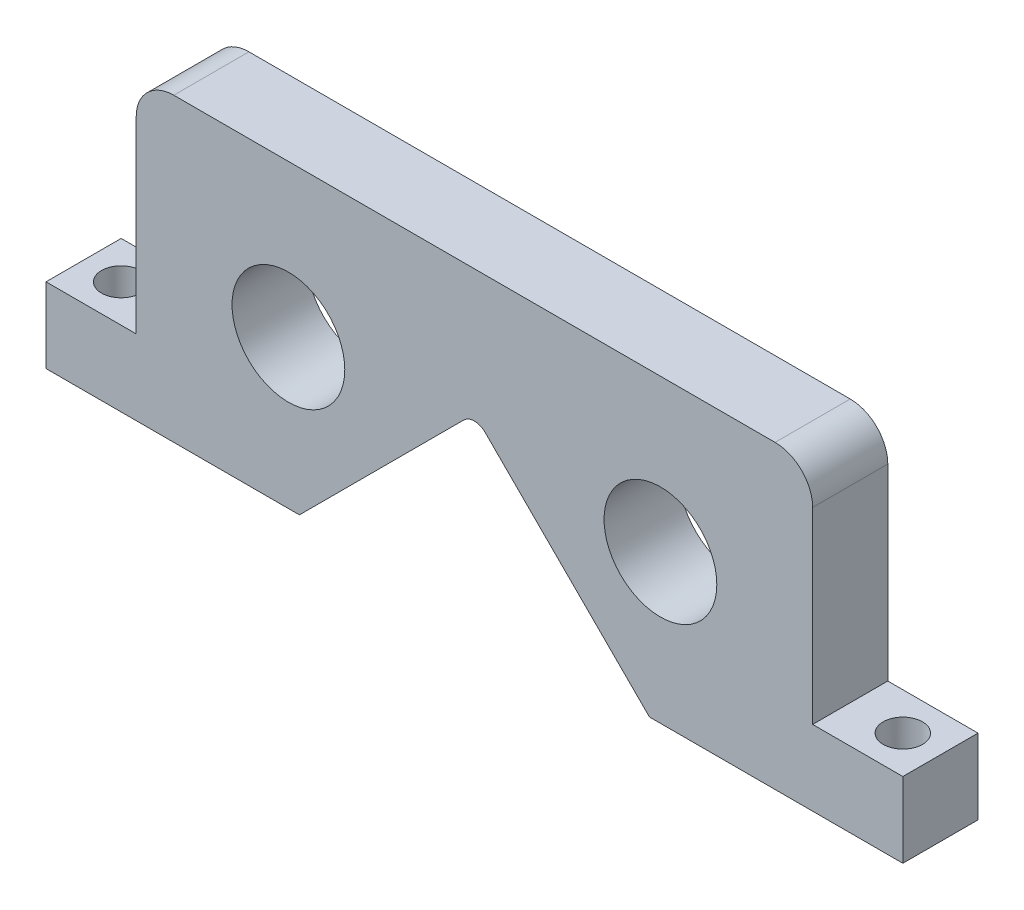
ISO-10303-21;
HEADER;
FILE_DESCRIPTION(('STEP AP214'),'2;1');
FILE_NAME('part.step','',(''),(''),'','','');
FILE_SCHEMA(('AUTOMOTIVE_DESIGN { 1 0 10303 214 1 1 1 1 }'));
ENDSEC;
DATA;
#1=APPLICATION_CONTEXT('core data for automotive mechanical design processes');
#2=APPLICATION_PROTOCOL_DEFINITION('international standard','automotive_design',2000,#1);
#3=PRODUCT_CONTEXT('',#1,'mechanical');
#4=PRODUCT('Part','Part','',(#3));
#5=PRODUCT_RELATED_PRODUCT_CATEGORY('part','',(#4));
#6=PRODUCT_DEFINITION_FORMATION('','',#4);
#7=PRODUCT_DEFINITION_CONTEXT('part definition',#1,'design');
#8=PRODUCT_DEFINITION('design','',#6,#7);
#9=PRODUCT_DEFINITION_SHAPE('','',#8);
#10=(LENGTH_UNIT() NAMED_UNIT(*) SI_UNIT(.MILLI.,.METRE.));
#11=(NAMED_UNIT(*) PLANE_ANGLE_UNIT() SI_UNIT($,.RADIAN.));
#12=(NAMED_UNIT(*) SI_UNIT($,.STERADIAN.) SOLID_ANGLE_UNIT());
#13=UNCERTAINTY_MEASURE_WITH_UNIT(LENGTH_MEASURE(1.E-05),#10,'distance_accuracy_value','');
#14=(GEOMETRIC_REPRESENTATION_CONTEXT(3) GLOBAL_UNCERTAINTY_ASSIGNED_CONTEXT((#13)) GLOBAL_UNIT_ASSIGNED_CONTEXT((#10,
#11,#12)) REPRESENTATION_CONTEXT('',''));
#15=CARTESIAN_POINT('',(0.,0.,0.));
#16=DIRECTION('',(0.,0.,1.));
#17=DIRECTION('',(1.,0.,0.));
#18=AXIS2_PLACEMENT_3D('',#15,#16,#17);
#19=CARTESIAN_POINT('',(0.,25.4558441227157,5.));
#20=DIRECTION('',(0.,0.,-1.));
#21=DIRECTION('',(-1.,0.,0.));
#22=AXIS2_PLACEMENT_3D('',#19,#20,#21);
#23=CYLINDRICAL_SURFACE('',#22,2.);
#24=CARTESIAN_POINT('',(0.,25.4558441227157,-5.));
#25=DIRECTION('',(0.,0.,1.));
#26=DIRECTION('',(1.,0.,0.));
#27=AXIS2_PLACEMENT_3D('',#24,#25,#26);
#28=CIRCLE('',#27,2.);
#29=CARTESIAN_POINT('',(1.41421356237311,26.8700576850888,-5.));
#30=VERTEX_POINT('',#29);
#31=CARTESIAN_POINT('',(-1.4142135623731,26.8700576850888,-5.));
#32=VERTEX_POINT('',#31);
#33=EDGE_CURVE('E184',#30,#32,#28,.T.);
#34=ORIENTED_EDGE('',*,*,#33,.F.);
#35=DIRECTION('',(0.,0.,-1.));
#36=VECTOR('',#35,1.);
#37=CARTESIAN_POINT('',(1.41421356237311,26.8700576850888,5.));
#38=LINE('',#37,#36);
#39=CARTESIAN_POINT('',(1.41421356237311,26.8700576850888,5.));
#40=VERTEX_POINT('',#39);
#41=EDGE_CURVE('E11',#40,#30,#38,.T.);
#42=ORIENTED_EDGE('',*,*,#41,.F.);
#43=CARTESIAN_POINT('',(0.,25.4558441227157,5.));
#44=DIRECTION('',(0.,0.,1.));
#45=DIRECTION('',(1.,0.,0.));
#46=AXIS2_PLACEMENT_3D('',#43,#44,#45);
#47=CIRCLE('',#46,2.);
#48=CARTESIAN_POINT('',(-1.4142135623731,26.8700576850888,5.));
#49=VERTEX_POINT('',#48);
#50=EDGE_CURVE('E176',#40,#49,#47,.T.);
#51=ORIENTED_EDGE('',*,*,#50,.T.);
#52=DIRECTION('',(0.,0.,-1.));
#53=VECTOR('',#52,1.);
#54=CARTESIAN_POINT('',(-1.4142135623731,26.8700576850888,5.));
#55=LINE('',#54,#53);
#56=EDGE_CURVE('E105',#49,#32,#55,.T.);
#57=ORIENTED_EDGE('',*,*,#56,.T.);
#58=EDGE_LOOP('',(#34,#42,#51,#57));
#59=FACE_BOUND('',#58,.T.);
#60=ADVANCED_FACE('F35',(#59),#23,.F.);
#61=CARTESIAN_POINT('',(14.142135623731,14.1421356237309,5.));
#62=DIRECTION('',(-0.707106781186548,-0.707106781186547,0.));
#63=DIRECTION('',(0.707106781186547,-0.707106781186548,0.));
#64=AXIS2_PLACEMENT_3D('',#61,#62,#63);
#65=PLANE('',#64);
#66=DIRECTION('',(-0.707106781186547,0.707106781186548,0.));
#67=VECTOR('',#66,1.);
#68=CARTESIAN_POINT('',(14.142135623731,14.1421356237309,-5.));
#69=LINE('',#68,#67);
#70=CARTESIAN_POINT('',(23.2842712474619,5.00000000000001,-5.));
#71=VERTEX_POINT('',#70);
#72=EDGE_CURVE('E218',#71,#30,#69,.T.);
#73=ORIENTED_EDGE('',*,*,#72,.F.);
#74=DIRECTION('',(0.,0.,-1.));
#75=VECTOR('',#74,1.);
#76=CARTESIAN_POINT('',(23.2842712474619,5.00000000000001,5.));
#77=LINE('',#76,#75);
#78=CARTESIAN_POINT('',(23.2842712474619,5.00000000000001,5.));
#79=VERTEX_POINT('',#78);
#80=EDGE_CURVE('E44',#79,#71,#77,.T.);
#81=ORIENTED_EDGE('',*,*,#80,.F.);
#82=DIRECTION('',(-0.707106781186547,0.707106781186548,0.));
#83=VECTOR('',#82,1.);
#84=CARTESIAN_POINT('',(14.142135623731,14.1421356237309,5.));
#85=LINE('',#84,#83);
#86=EDGE_CURVE('E168',#79,#40,#85,.T.);
#87=ORIENTED_EDGE('',*,*,#86,.T.);
#88=ORIENTED_EDGE('',*,*,#41,.T.);
#89=EDGE_LOOP('',(#73,#81,#87,#88));
#90=FACE_BOUND('',#89,.T.);
#91=ADVANCED_FACE('F209',(#90),#65,.T.);
#92=CARTESIAN_POINT('',(0.,5.00000000000001,5.));
#93=DIRECTION('',(0.,1.,0.));
#94=DIRECTION('',(0.,0.,1.));
#95=AXIS2_PLACEMENT_3D('',#92,#93,#94);
#96=PLANE('',#95);
#97=CARTESIAN_POINT('',(52.,5.00000000000001,0.));
#98=DIRECTION('',(0.,-1.,0.));
#99=DIRECTION('',(0.,0.,1.));
#100=AXIS2_PLACEMENT_3D('',#97,#98,#99);
#101=CIRCLE('',#100,2.61209519362042);
#102=CARTESIAN_POINT('',(52.,5.00000000000001,2.61209519362042));
#103=VERTEX_POINT('',#102);
#104=EDGE_CURVE('E188',#103,#103,#101,.T.);
#105=ORIENTED_EDGE('',*,*,#104,.F.);
#106=EDGE_LOOP('',(#105));
#107=FACE_BOUND('',#106,.T.);
#108=DIRECTION('',(1.,0.,0.));
#109=VECTOR('',#108,1.);
#110=CARTESIAN_POINT('',(0.,5.00000000000001,-5.));
#111=LINE('',#110,#109);
#112=CARTESIAN_POINT('',(57.,5.00000000000001,-5.));
#113=VERTEX_POINT('',#112);
#114=EDGE_CURVE('E225',#71,#113,#111,.T.);
#115=ORIENTED_EDGE('',*,*,#114,.T.);
#116=DIRECTION('',(0.,0.,-1.));
#117=VECTOR('',#116,1.);
#118=CARTESIAN_POINT('',(57.,5.00000000000001,5.));
#119=LINE('',#118,#117);
#120=CARTESIAN_POINT('',(57.,5.00000000000001,5.));
#121=VERTEX_POINT('',#120);
#122=EDGE_CURVE('E278',#121,#113,#119,.T.);
#123=ORIENTED_EDGE('',*,*,#122,.F.);
#124=DIRECTION('',(1.,0.,0.));
#125=VECTOR('',#124,1.);
#126=CARTESIAN_POINT('',(0.,5.00000000000001,5.));
#127=LINE('',#126,#125);
#128=EDGE_CURVE('E162',#79,#121,#127,.T.);
#129=ORIENTED_EDGE('',*,*,#128,.F.);
#130=ORIENTED_EDGE('',*,*,#80,.T.);
#131=EDGE_LOOP('',(#115,#123,#129,#130));
#132=FACE_BOUND('',#131,.T.);
#133=ADVANCED_FACE('F213',(#107,#132),#96,.F.);
#134=CARTESIAN_POINT('',(57.,0.,5.));
#135=DIRECTION('',(1.,0.,0.));
#136=DIRECTION('',(0.,0.,-1.));
#137=AXIS2_PLACEMENT_3D('',#134,#135,#136);
#138=PLANE('',#137);
#139=DIRECTION('',(0.,-1.,0.));
#140=VECTOR('',#139,1.);
#141=CARTESIAN_POINT('',(57.,0.,-5.));
#142=LINE('',#141,#140);
#143=CARTESIAN_POINT('',(57.,15.,-5.));
#144=VERTEX_POINT('',#143);
#145=EDGE_CURVE('E227',#144,#113,#142,.T.);
#146=ORIENTED_EDGE('',*,*,#145,.F.);
#147=DIRECTION('',(0.,0.,-1.));
#148=VECTOR('',#147,1.);
#149=CARTESIAN_POINT('',(57.,15.,5.));
#150=LINE('',#149,#148);
#151=CARTESIAN_POINT('',(57.,15.,5.));
#152=VERTEX_POINT('',#151);
#153=EDGE_CURVE('E276',#152,#144,#150,.T.);
#154=ORIENTED_EDGE('',*,*,#153,.F.);
#155=DIRECTION('',(0.,-1.,0.));
#156=VECTOR('',#155,1.);
#157=CARTESIAN_POINT('',(57.,0.,5.));
#158=LINE('',#157,#156);
#159=EDGE_CURVE('E167',#152,#121,#158,.T.);
#160=ORIENTED_EDGE('',*,*,#159,.T.);
#161=ORIENTED_EDGE('',*,*,#122,.T.);
#162=EDGE_LOOP('',(#146,#154,#160,#161));
#163=FACE_BOUND('',#162,.T.);
#164=ADVANCED_FACE('F283',(#163),#138,.T.);
#165=CARTESIAN_POINT('',(0.,15.,5.));
#166=DIRECTION('',(0.,-1.,0.));
#167=DIRECTION('',(1.,0.,0.));
#168=AXIS2_PLACEMENT_3D('',#165,#166,#167);
#169=PLANE('',#168);
#170=CARTESIAN_POINT('',(52.,15.,0.));
#171=DIRECTION('',(0.,-1.,0.));
#172=DIRECTION('',(1.,0.,0.));
#173=AXIS2_PLACEMENT_3D('',#170,#171,#172);
#174=CIRCLE('',#173,2.61209519362042);
#175=CARTESIAN_POINT('',(54.6120951936205,15.,0.));
#176=VERTEX_POINT('',#175);
#177=EDGE_CURVE('E38',#176,#176,#174,.T.);
#178=ORIENTED_EDGE('',*,*,#177,.T.);
#179=EDGE_LOOP('',(#178));
#180=FACE_BOUND('',#179,.T.);
#181=DIRECTION('',(-1.,0.,0.));
#182=VECTOR('',#181,1.);
#183=CARTESIAN_POINT('',(0.,15.,-5.));
#184=LINE('',#183,#182);
#185=CARTESIAN_POINT('',(45.,15.,-5.));
#186=VERTEX_POINT('',#185);
#187=EDGE_CURVE('E232',#144,#186,#184,.T.);
#188=ORIENTED_EDGE('',*,*,#187,.T.);
#189=DIRECTION('',(0.,0.,-1.));
#190=VECTOR('',#189,1.);
#191=CARTESIAN_POINT('',(45.,15.,5.));
#192=LINE('',#191,#190);
#193=CARTESIAN_POINT('',(45.,15.,5.));
#194=VERTEX_POINT('',#193);
#195=EDGE_CURVE('E273',#194,#186,#192,.T.);
#196=ORIENTED_EDGE('',*,*,#195,.F.);
#197=DIRECTION('',(-1.,0.,0.));
#198=VECTOR('',#197,1.);
#199=CARTESIAN_POINT('',(0.,15.,5.));
#200=LINE('',#199,#198);
#201=EDGE_CURVE('E174',#152,#194,#200,.T.);
#202=ORIENTED_EDGE('',*,*,#201,.F.);
#203=ORIENTED_EDGE('',*,*,#153,.T.);
#204=EDGE_LOOP('',(#188,#196,#202,#203));
#205=FACE_BOUND('',#204,.T.);
#206=ADVANCED_FACE('F195',(#180,#205),#169,.F.);
#207=CARTESIAN_POINT('',(45.,0.,5.));
#208=DIRECTION('',(-1.,0.,0.));
#209=DIRECTION('',(0.,-1.,0.));
#210=AXIS2_PLACEMENT_3D('',#207,#208,#209);
#211=PLANE('',#210);
#212=DIRECTION('',(0.,1.,0.));
#213=VECTOR('',#212,1.);
#214=CARTESIAN_POINT('',(45.,0.,-5.));
#215=LINE('',#214,#213);
#216=CARTESIAN_POINT('',(45.,40.,-5.));
#217=VERTEX_POINT('',#216);
#218=EDGE_CURVE('E234',#186,#217,#215,.T.);
#219=ORIENTED_EDGE('',*,*,#218,.T.);
#220=DIRECTION('',(0.,0.,-1.));
#221=VECTOR('',#220,1.);
#222=CARTESIAN_POINT('',(45.,40.,5.));
#223=LINE('',#222,#221);
#224=CARTESIAN_POINT('',(45.,40.,5.));
#225=VERTEX_POINT('',#224);
#226=EDGE_CURVE('E270',#225,#217,#223,.T.);
#227=ORIENTED_EDGE('',*,*,#226,.F.);
#228=DIRECTION('',(0.,1.,0.));
#229=VECTOR('',#228,1.);
#230=CARTESIAN_POINT('',(45.,0.,5.));
#231=LINE('',#230,#229);
#232=EDGE_CURVE('E287',#194,#225,#231,.T.);
#233=ORIENTED_EDGE('',*,*,#232,.F.);
#234=ORIENTED_EDGE('',*,*,#195,.T.);
#235=EDGE_LOOP('',(#219,#227,#233,#234));
#236=FACE_BOUND('',#235,.T.);
#237=ADVANCED_FACE('F293',(#236),#211,.F.);
#238=CARTESIAN_POINT('',(40.,40.,5.));
#239=DIRECTION('',(0.,0.,-1.));
#240=DIRECTION('',(-1.,0.,0.));
#241=AXIS2_PLACEMENT_3D('',#238,#239,#240);
#242=CYLINDRICAL_SURFACE('',#241,4.99999999999999);
#243=CARTESIAN_POINT('',(40.,40.,-5.));
#244=DIRECTION('',(0.,0.,1.));
#245=DIRECTION('',(1.,0.,0.));
#246=AXIS2_PLACEMENT_3D('',#243,#244,#245);
#247=CIRCLE('',#246,4.99999999999999);
#248=CARTESIAN_POINT('',(40.,45.,-5.));
#249=VERTEX_POINT('',#248);
#250=EDGE_CURVE('E236',#217,#249,#247,.T.);
#251=ORIENTED_EDGE('',*,*,#250,.T.);
#252=DIRECTION('',(0.,0.,-1.));
#253=VECTOR('',#252,1.);
#254=CARTESIAN_POINT('',(40.,45.,5.));
#255=LINE('',#254,#253);
#256=CARTESIAN_POINT('',(40.,45.,5.));
#257=VERTEX_POINT('',#256);
#258=EDGE_CURVE('E267',#257,#249,#255,.T.);
#259=ORIENTED_EDGE('',*,*,#258,.F.);
#260=CARTESIAN_POINT('',(40.,40.,5.));
#261=DIRECTION('',(0.,0.,1.));
#262=DIRECTION('',(1.,0.,0.));
#263=AXIS2_PLACEMENT_3D('',#260,#261,#262);
#264=CIRCLE('',#263,4.99999999999999);
#265=EDGE_CURVE('E295',#225,#257,#264,.T.);
#266=ORIENTED_EDGE('',*,*,#265,.F.);
#267=ORIENTED_EDGE('',*,*,#226,.T.);
#268=EDGE_LOOP('',(#251,#259,#266,#267));
#269=FACE_BOUND('',#268,.T.);
#270=ADVANCED_FACE('F352',(#269),#242,.T.);
#271=CARTESIAN_POINT('',(0.,45.,5.));
#272=DIRECTION('',(0.,-1.,0.));
#273=DIRECTION('',(0.,0.,-1.));
#274=AXIS2_PLACEMENT_3D('',#271,#272,#273);
#275=PLANE('',#274);
#276=DIRECTION('',(-1.,0.,0.));
#277=VECTOR('',#276,1.);
#278=CARTESIAN_POINT('',(0.,45.,-5.));
#279=LINE('',#278,#277);
#280=CARTESIAN_POINT('',(-40.,45.,-5.));
#281=VERTEX_POINT('',#280);
#282=EDGE_CURVE('E238',#249,#281,#279,.T.);
#283=ORIENTED_EDGE('',*,*,#282,.T.);
#284=DIRECTION('',(0.,0.,-1.));
#285=VECTOR('',#284,1.);
#286=CARTESIAN_POINT('',(-40.,45.,5.));
#287=LINE('',#286,#285);
#288=CARTESIAN_POINT('',(-40.,45.,5.));
#289=VERTEX_POINT('',#288);
#290=EDGE_CURVE('E264',#289,#281,#287,.T.);
#291=ORIENTED_EDGE('',*,*,#290,.F.);
#292=DIRECTION('',(-1.,0.,0.));
#293=VECTOR('',#292,1.);
#294=CARTESIAN_POINT('',(0.,45.,5.));
#295=LINE('',#294,#293);
#296=EDGE_CURVE('E297',#257,#289,#295,.T.);
#297=ORIENTED_EDGE('',*,*,#296,.F.);
#298=ORIENTED_EDGE('',*,*,#258,.T.);
#299=EDGE_LOOP('',(#283,#291,#297,#298));
#300=FACE_BOUND('',#299,.T.);
#301=ADVANCED_FACE('F348',(#300),#275,.F.);
#302=CARTESIAN_POINT('',(-40.,40.,5.));
#303=DIRECTION('',(0.,0.,-1.));
#304=DIRECTION('',(-1.,0.,0.));
#305=AXIS2_PLACEMENT_3D('',#302,#303,#304);
#306=CYLINDRICAL_SURFACE('',#305,4.99999999999999);
#307=CARTESIAN_POINT('',(-40.,40.,-5.));
#308=DIRECTION('',(0.,0.,1.));
#309=DIRECTION('',(1.,0.,0.));
#310=AXIS2_PLACEMENT_3D('',#307,#308,#309);
#311=CIRCLE('',#310,4.99999999999999);
#312=CARTESIAN_POINT('',(-45.,40.,-5.));
#313=VERTEX_POINT('',#312);
#314=EDGE_CURVE('E240',#281,#313,#311,.T.);
#315=ORIENTED_EDGE('',*,*,#314,.T.);
#316=DIRECTION('',(0.,0.,-1.));
#317=VECTOR('',#316,1.);
#318=CARTESIAN_POINT('',(-45.,40.,5.));
#319=LINE('',#318,#317);
#320=CARTESIAN_POINT('',(-45.,40.,5.));
#321=VERTEX_POINT('',#320);
#322=EDGE_CURVE('E261',#321,#313,#319,.T.);
#323=ORIENTED_EDGE('',*,*,#322,.F.);
#324=CARTESIAN_POINT('',(-40.,40.,5.));
#325=DIRECTION('',(0.,0.,1.));
#326=DIRECTION('',(1.,0.,0.));
#327=AXIS2_PLACEMENT_3D('',#324,#325,#326);
#328=CIRCLE('',#327,4.99999999999999);
#329=EDGE_CURVE('E301',#289,#321,#328,.T.);
#330=ORIENTED_EDGE('',*,*,#329,.F.);
#331=ORIENTED_EDGE('',*,*,#290,.T.);
#332=EDGE_LOOP('',(#315,#323,#330,#331));
#333=FACE_BOUND('',#332,.T.);
#334=ADVANCED_FACE('F344',(#333),#306,.T.);
#335=CARTESIAN_POINT('',(-45.,0.,5.));
#336=DIRECTION('',(1.,0.,0.));
#337=DIRECTION('',(0.,1.,0.));
#338=AXIS2_PLACEMENT_3D('',#335,#336,#337);
#339=PLANE('',#338);
#340=DIRECTION('',(0.,-1.,0.));
#341=VECTOR('',#340,1.);
#342=CARTESIAN_POINT('',(-45.,0.,-5.));
#343=LINE('',#342,#341);
#344=CARTESIAN_POINT('',(-45.,15.,-5.));
#345=VERTEX_POINT('',#344);
#346=EDGE_CURVE('E242',#313,#345,#343,.T.);
#347=ORIENTED_EDGE('',*,*,#346,.T.);
#348=DIRECTION('',(0.,0.,-1.));
#349=VECTOR('',#348,1.);
#350=CARTESIAN_POINT('',(-45.,15.,5.));
#351=LINE('',#350,#349);
#352=CARTESIAN_POINT('',(-45.,15.,5.));
#353=VERTEX_POINT('',#352);
#354=EDGE_CURVE('E258',#353,#345,#351,.T.);
#355=ORIENTED_EDGE('',*,*,#354,.F.);
#356=DIRECTION('',(0.,-1.,0.));
#357=VECTOR('',#356,1.);
#358=CARTESIAN_POINT('',(-45.,0.,5.));
#359=LINE('',#358,#357);
#360=EDGE_CURVE('E303',#321,#353,#359,.T.);
#361=ORIENTED_EDGE('',*,*,#360,.F.);
#362=ORIENTED_EDGE('',*,*,#322,.T.);
#363=EDGE_LOOP('',(#347,#355,#361,#362));
#364=FACE_BOUND('',#363,.T.);
#365=ADVANCED_FACE('F340',(#364),#339,.F.);
#366=CARTESIAN_POINT('',(0.,15.,5.));
#367=DIRECTION('',(0.,-1.,0.));
#368=DIRECTION('',(1.,0.,0.));
#369=AXIS2_PLACEMENT_3D('',#366,#367,#368);
#370=PLANE('',#369);
#371=CARTESIAN_POINT('',(-52.,15.,0.));
#372=DIRECTION('',(0.,-1.,0.));
#373=DIRECTION('',(1.,0.,0.));
#374=AXIS2_PLACEMENT_3D('',#371,#372,#373);
#375=CIRCLE('',#374,2.61209519362042);
#376=CARTESIAN_POINT('',(-49.3879048063796,15.,0.));
#377=VERTEX_POINT('',#376);
#378=EDGE_CURVE('E181',#377,#377,#375,.T.);
#379=ORIENTED_EDGE('',*,*,#378,.T.);
#380=EDGE_LOOP('',(#379));
#381=FACE_BOUND('',#380,.T.);
#382=DIRECTION('',(-1.,0.,0.));
#383=VECTOR('',#382,1.);
#384=CARTESIAN_POINT('',(0.,15.,-5.));
#385=LINE('',#384,#383);
#386=CARTESIAN_POINT('',(-57.,15.,-5.));
#387=VERTEX_POINT('',#386);
#388=EDGE_CURVE('E244',#345,#387,#385,.T.);
#389=ORIENTED_EDGE('',*,*,#388,.T.);
#390=DIRECTION('',(0.,0.,-1.));
#391=VECTOR('',#390,1.);
#392=CARTESIAN_POINT('',(-57.,15.,5.));
#393=LINE('',#392,#391);
#394=CARTESIAN_POINT('',(-57.,15.,5.));
#395=VERTEX_POINT('',#394);
#396=EDGE_CURVE('E157',#395,#387,#393,.T.);
#397=ORIENTED_EDGE('',*,*,#396,.F.);
#398=DIRECTION('',(-1.,0.,0.));
#399=VECTOR('',#398,1.);
#400=CARTESIAN_POINT('',(0.,15.,5.));
#401=LINE('',#400,#399);
#402=EDGE_CURVE('E148',#353,#395,#401,.T.);
#403=ORIENTED_EDGE('',*,*,#402,.F.);
#404=ORIENTED_EDGE('',*,*,#354,.T.);
#405=EDGE_LOOP('',(#389,#397,#403,#404));
#406=FACE_BOUND('',#405,.T.);
#407=ADVANCED_FACE('F337',(#381,#406),#370,.F.);
#408=CARTESIAN_POINT('',(-57.,0.,5.));
#409=DIRECTION('',(1.,0.,0.));
#410=DIRECTION('',(0.,0.,-1.));
#411=AXIS2_PLACEMENT_3D('',#408,#409,#410);
#412=PLANE('',#411);
#413=DIRECTION('',(0.,-1.,0.));
#414=VECTOR('',#413,1.);
#415=CARTESIAN_POINT('',(-57.,0.,-5.));
#416=LINE('',#415,#414);
#417=CARTESIAN_POINT('',(-57.,5.00000000000001,-5.));
#418=VERTEX_POINT('',#417);
#419=EDGE_CURVE('E156',#387,#418,#416,.T.);
#420=ORIENTED_EDGE('',*,*,#419,.T.);
#421=DIRECTION('',(0.,0.,-1.));
#422=VECTOR('',#421,1.);
#423=CARTESIAN_POINT('',(-57.,5.00000000000001,5.));
#424=LINE('',#423,#422);
#425=CARTESIAN_POINT('',(-57.,5.00000000000001,5.));
#426=VERTEX_POINT('',#425);
#427=EDGE_CURVE('E153',#426,#418,#424,.T.);
#428=ORIENTED_EDGE('',*,*,#427,.F.);
#429=DIRECTION('',(0.,-1.,0.));
#430=VECTOR('',#429,1.);
#431=CARTESIAN_POINT('',(-57.,0.,5.));
#432=LINE('',#431,#430);
#433=EDGE_CURVE('E141',#395,#426,#432,.T.);
#434=ORIENTED_EDGE('',*,*,#433,.F.);
#435=ORIENTED_EDGE('',*,*,#396,.T.);
#436=EDGE_LOOP('',(#420,#428,#434,#435));
#437=FACE_BOUND('',#436,.T.);
#438=ADVANCED_FACE('F154',(#437),#412,.F.);
#439=CARTESIAN_POINT('',(-52.,5.00000000000001,0.));
#440=DIRECTION('',(0.,-1.,0.));
#441=DIRECTION('',(0.,0.,-1.));
#442=AXIS2_PLACEMENT_3D('',#439,#440,#441);
#443=CIRCLE('',#442,2.61209519362042);
#444=CARTESIAN_POINT('',(-52.,5.00000000000001,-2.61209519362042));
#445=VERTEX_POINT('',#444);
#446=EDGE_CURVE('E185',#445,#445,#443,.T.);
#447=ORIENTED_EDGE('',*,*,#446,.F.);
#448=EDGE_LOOP('',(#447));
#449=FACE_BOUND('',#448,.T.);
#450=CARTESIAN_POINT('',(-23.2842712474619,5.00000000000001,-5.));
#451=VERTEX_POINT('',#450);
#452=EDGE_CURVE('E98',#418,#451,#111,.T.);
#453=ORIENTED_EDGE('',*,*,#452,.T.);
#454=DIRECTION('',(0.,0.,-1.));
#455=VECTOR('',#454,1.);
#456=CARTESIAN_POINT('',(-23.2842712474619,5.00000000000001,5.));
#457=LINE('',#456,#455);
#458=CARTESIAN_POINT('',(-23.2842712474619,5.00000000000001,5.));
#459=VERTEX_POINT('',#458);
#460=EDGE_CURVE('E158',#459,#451,#457,.T.);
#461=ORIENTED_EDGE('',*,*,#460,.F.);
#462=EDGE_CURVE('E146',#426,#459,#127,.T.);
#463=ORIENTED_EDGE('',*,*,#462,.F.);
#464=ORIENTED_EDGE('',*,*,#427,.T.);
#465=EDGE_LOOP('',(#453,#461,#463,#464));
#466=FACE_BOUND('',#465,.T.);
#467=ADVANCED_FACE('F160',(#449,#466),#96,.F.);
#468=CARTESIAN_POINT('',(-24.7487373415292,24.7487373415292,5.));
#469=DIRECTION('',(0.,0.,-1.));
#470=DIRECTION('',(-1.,0.,0.));
#471=AXIS2_PLACEMENT_3D('',#468,#469,#470);
#472=CYLINDRICAL_SURFACE('',#471,7.50000000000001);
#473=CARTESIAN_POINT('',(-24.7487373415292,24.7487373415292,5.));
#474=DIRECTION('',(0.,0.,1.));
#475=DIRECTION('',(1.,0.,0.));
#476=AXIS2_PLACEMENT_3D('',#473,#474,#475);
#477=CIRCLE('',#476,7.50000000000001);
#478=CARTESIAN_POINT('',(-17.2487373415292,24.7487373415292,5.));
#479=VERTEX_POINT('',#478);
#480=EDGE_CURVE('E163',#479,#479,#477,.T.);
#481=ORIENTED_EDGE('',*,*,#480,.T.);
#482=EDGE_LOOP('',(#481));
#483=FACE_BOUND('',#482,.T.);
#484=CARTESIAN_POINT('',(-24.7487373415292,24.7487373415292,-5.));
#485=DIRECTION('',(0.,0.,1.));
#486=DIRECTION('',(1.,0.,0.));
#487=AXIS2_PLACEMENT_3D('',#484,#485,#486);
#488=CIRCLE('',#487,7.50000000000001);
#489=CARTESIAN_POINT('',(-17.2487373415292,24.7487373415292,-5.));
#490=VERTEX_POINT('',#489);
#491=EDGE_CURVE('E249',#490,#490,#488,.T.);
#492=ORIENTED_EDGE('',*,*,#491,.F.);
#493=EDGE_LOOP('',(#492));
#494=FACE_BOUND('',#493,.T.);
#495=ADVANCED_FACE('F325',(#483,#494),#472,.F.);
#496=CARTESIAN_POINT('',(-14.1421356237309,14.142135623731,5.));
#497=DIRECTION('',(-0.707106781186547,0.707106781186548,0.));
#498=DIRECTION('',(-0.707106781186548,-0.707106781186547,0.));
#499=AXIS2_PLACEMENT_3D('',#496,#497,#498);
#500=PLANE('',#499);
#501=DIRECTION('',(0.707106781186548,0.707106781186547,0.));
#502=VECTOR('',#501,1.);
#503=CARTESIAN_POINT('',(-14.1421356237309,14.142135623731,-5.));
#504=LINE('',#503,#502);
#505=EDGE_CURVE('E247',#451,#32,#504,.T.);
#506=ORIENTED_EDGE('',*,*,#505,.T.);
#507=ORIENTED_EDGE('',*,*,#56,.F.);
#508=DIRECTION('',(0.707106781186548,0.707106781186547,0.));
#509=VECTOR('',#508,1.);
#510=CARTESIAN_POINT('',(-14.1421356237309,14.142135623731,5.));
#511=LINE('',#510,#509);
#512=EDGE_CURVE('E52',#459,#49,#511,.T.);
#513=ORIENTED_EDGE('',*,*,#512,.F.);
#514=ORIENTED_EDGE('',*,*,#460,.T.);
#515=EDGE_LOOP('',(#506,#507,#513,#514));
#516=FACE_BOUND('',#515,.T.);
#517=ADVANCED_FACE('F314',(#516),#500,.F.);
#518=CARTESIAN_POINT('',(24.7487373415292,24.7487373415292,5.));
#519=DIRECTION('',(0.,0.,-1.));
#520=DIRECTION('',(-1.,0.,0.));
#521=AXIS2_PLACEMENT_3D('',#518,#519,#520);
#522=CYLINDRICAL_SURFACE('',#521,7.49999999999998);
#523=CARTESIAN_POINT('',(24.7487373415292,24.7487373415292,5.));
#524=DIRECTION('',(0.,0.,1.));
#525=DIRECTION('',(1.,0.,0.));
#526=AXIS2_PLACEMENT_3D('',#523,#524,#525);
#527=CIRCLE('',#526,7.49999999999998);
#528=CARTESIAN_POINT('',(32.2487373415292,24.7487373415292,5.));
#529=VERTEX_POINT('',#528);
#530=EDGE_CURVE('E255',#529,#529,#527,.F.);
#531=ORIENTED_EDGE('',*,*,#530,.F.);
#532=EDGE_LOOP('',(#531));
#533=FACE_BOUND('',#532,.T.);
#534=CARTESIAN_POINT('',(24.7487373415292,24.7487373415292,-5.));
#535=DIRECTION('',(0.,0.,1.));
#536=DIRECTION('',(1.,0.,0.));
#537=AXIS2_PLACEMENT_3D('',#534,#535,#536);
#538=CIRCLE('',#537,7.49999999999998);
#539=CARTESIAN_POINT('',(32.2487373415292,24.7487373415292,-5.));
#540=VERTEX_POINT('',#539);
#541=EDGE_CURVE('E178',#540,#540,#538,.F.);
#542=ORIENTED_EDGE('',*,*,#541,.T.);
#543=EDGE_LOOP('',(#542));
#544=FACE_BOUND('',#543,.T.);
#545=ADVANCED_FACE('F311',(#533,#544),#522,.F.);
#546=CARTESIAN_POINT('',(0.,0.,5.));
#547=DIRECTION('',(0.,0.,1.));
#548=DIRECTION('',(1.,0.,0.));
#549=AXIS2_PLACEMENT_3D('',#546,#547,#548);
#550=PLANE('',#549);
#551=ORIENTED_EDGE('',*,*,#50,.F.);
#552=ORIENTED_EDGE('',*,*,#86,.F.);
#553=ORIENTED_EDGE('',*,*,#128,.T.);
#554=ORIENTED_EDGE('',*,*,#159,.F.);
#555=ORIENTED_EDGE('',*,*,#201,.T.);
#556=ORIENTED_EDGE('',*,*,#232,.T.);
#557=ORIENTED_EDGE('',*,*,#265,.T.);
#558=ORIENTED_EDGE('',*,*,#296,.T.);
#559=ORIENTED_EDGE('',*,*,#329,.T.);
#560=ORIENTED_EDGE('',*,*,#360,.T.);
#561=ORIENTED_EDGE('',*,*,#402,.T.);
#562=ORIENTED_EDGE('',*,*,#433,.T.);
#563=ORIENTED_EDGE('',*,*,#462,.T.);
#564=ORIENTED_EDGE('',*,*,#512,.T.);
#565=EDGE_LOOP('',(#551,#552,#553,#554,#555,#556,#557,#558,#559,#560,#561,#562,#563,#564));
#566=FACE_BOUND('',#565,.T.);
#567=ORIENTED_EDGE('',*,*,#480,.F.);
#568=EDGE_LOOP('',(#567));
#569=FACE_BOUND('',#568,.T.);
#570=ORIENTED_EDGE('',*,*,#530,.T.);
#571=EDGE_LOOP('',(#570));
#572=FACE_BOUND('',#571,.T.);
#573=ADVANCED_FACE('F143',(#566,#569,#572),#550,.T.);
#574=CARTESIAN_POINT('',(0.,0.,-5.));
#575=DIRECTION('',(0.,0.,1.));
#576=DIRECTION('',(1.,0.,0.));
#577=AXIS2_PLACEMENT_3D('',#574,#575,#576);
#578=PLANE('',#577);
#579=ORIENTED_EDGE('',*,*,#33,.T.);
#580=ORIENTED_EDGE('',*,*,#505,.F.);
#581=ORIENTED_EDGE('',*,*,#452,.F.);
#582=ORIENTED_EDGE('',*,*,#419,.F.);
#583=ORIENTED_EDGE('',*,*,#388,.F.);
#584=ORIENTED_EDGE('',*,*,#346,.F.);
#585=ORIENTED_EDGE('',*,*,#314,.F.);
#586=ORIENTED_EDGE('',*,*,#282,.F.);
#587=ORIENTED_EDGE('',*,*,#250,.F.);
#588=ORIENTED_EDGE('',*,*,#218,.F.);
#589=ORIENTED_EDGE('',*,*,#187,.F.);
#590=ORIENTED_EDGE('',*,*,#145,.T.);
#591=ORIENTED_EDGE('',*,*,#114,.F.);
#592=ORIENTED_EDGE('',*,*,#72,.T.);
#593=EDGE_LOOP('',(#579,#580,#581,#582,#583,#584,#585,#586,#587,#588,#589,#590,#591,#592));
#594=FACE_BOUND('',#593,.T.);
#595=ORIENTED_EDGE('',*,*,#491,.T.);
#596=EDGE_LOOP('',(#595));
#597=FACE_BOUND('',#596,.T.);
#598=ORIENTED_EDGE('',*,*,#541,.F.);
#599=EDGE_LOOP('',(#598));
#600=FACE_BOUND('',#599,.T.);
#601=ADVANCED_FACE('F205',(#594,#597,#600),#578,.F.);
#602=CARTESIAN_POINT('',(-52.,45.,0.));
#603=DIRECTION('',(0.,-1.,0.));
#604=DIRECTION('',(0.,0.,-1.));
#605=AXIS2_PLACEMENT_3D('',#602,#603,#604);
#606=CYLINDRICAL_SURFACE('',#605,2.61209519362042);
#607=ORIENTED_EDGE('',*,*,#446,.T.);
#608=EDGE_LOOP('',(#607));
#609=FACE_BOUND('',#608,.T.);
#610=ORIENTED_EDGE('',*,*,#378,.F.);
#611=EDGE_LOOP('',(#610));
#612=FACE_BOUND('',#611,.T.);
#613=ADVANCED_FACE('F200',(#609,#612),#606,.F.);
#614=CARTESIAN_POINT('',(52.,45.,0.));
#615=DIRECTION('',(0.,-1.,0.));
#616=DIRECTION('',(0.,0.,-1.));
#617=AXIS2_PLACEMENT_3D('',#614,#615,#616);
#618=CYLINDRICAL_SURFACE('',#617,2.61209519362042);
#619=ORIENTED_EDGE('',*,*,#104,.T.);
#620=EDGE_LOOP('',(#619));
#621=FACE_BOUND('',#620,.T.);
#622=ORIENTED_EDGE('',*,*,#177,.F.);
#623=EDGE_LOOP('',(#622));
#624=FACE_BOUND('',#623,.T.);
#625=ADVANCED_FACE('F198',(#621,#624),#618,.F.);
#626=CLOSED_SHELL('',(#60,#91,#133,#164,#206,#237,#270,#301,#334,#365,#407,#438,#467,#495,#517,
#545,#573,#601,#613,#625));
#627=MANIFOLD_SOLID_BREP('B2',#626);
#628=ADVANCED_BREP_SHAPE_REPRESENTATION('',(#18,#627),#14);
#629=SHAPE_DEFINITION_REPRESENTATION(#9,#628);
ENDSEC;
END-ISO-10303-21;
